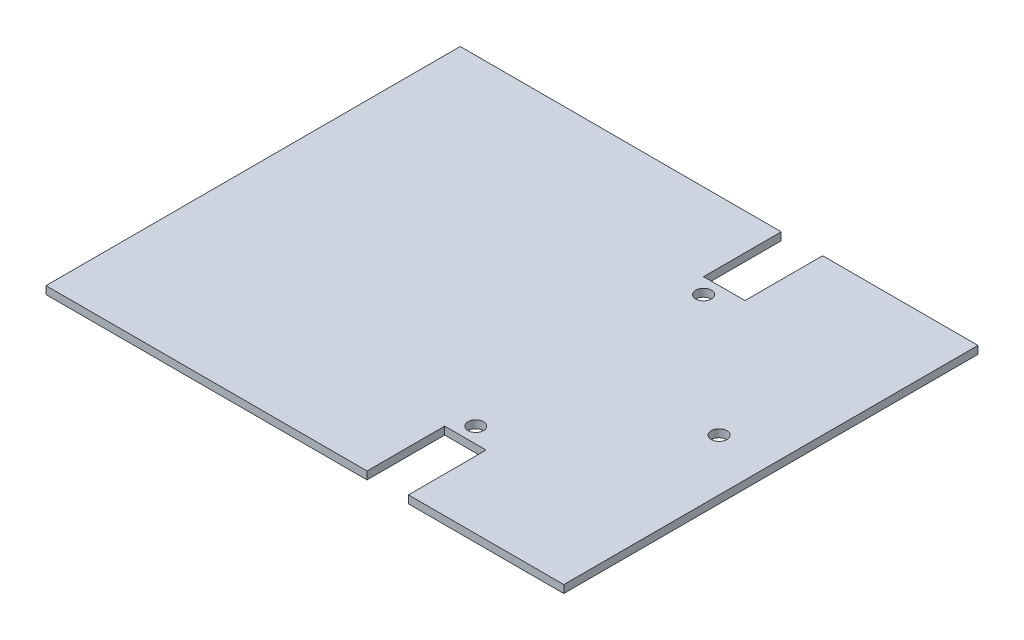
ISO-10303-21;
HEADER;
FILE_DESCRIPTION(('STEP AP214'),'2;1');
FILE_NAME('part.step','',(''),(''),'','','');
FILE_SCHEMA(('AUTOMOTIVE_DESIGN { 1 0 10303 214 1 1 1 1 }'));
ENDSEC;
DATA;
#1=APPLICATION_CONTEXT('core data for automotive mechanical design processes');
#2=APPLICATION_PROTOCOL_DEFINITION('international standard','automotive_design',2000,#1);
#3=PRODUCT_CONTEXT('',#1,'mechanical');
#4=PRODUCT('Part','Part','',(#3));
#5=PRODUCT_RELATED_PRODUCT_CATEGORY('part','',(#4));
#6=PRODUCT_DEFINITION_FORMATION('','',#4);
#7=PRODUCT_DEFINITION_CONTEXT('part definition',#1,'design');
#8=PRODUCT_DEFINITION('design','',#6,#7);
#9=PRODUCT_DEFINITION_SHAPE('','',#8);
#10=(LENGTH_UNIT() NAMED_UNIT(*) SI_UNIT(.MILLI.,.METRE.));
#11=(NAMED_UNIT(*) PLANE_ANGLE_UNIT() SI_UNIT($,.RADIAN.));
#12=(NAMED_UNIT(*) SI_UNIT($,.STERADIAN.) SOLID_ANGLE_UNIT());
#13=UNCERTAINTY_MEASURE_WITH_UNIT(LENGTH_MEASURE(1.E-05),#10,'distance_accuracy_value','');
#14=(GEOMETRIC_REPRESENTATION_CONTEXT(3) GLOBAL_UNCERTAINTY_ASSIGNED_CONTEXT((#13)) GLOBAL_UNIT_ASSIGNED_CONTEXT((#10,
#11,#12)) REPRESENTATION_CONTEXT('',''));
#15=CARTESIAN_POINT('',(0.,0.,0.));
#16=DIRECTION('',(0.,0.,1.));
#17=DIRECTION('',(1.,0.,0.));
#18=AXIS2_PLACEMENT_3D('',#15,#16,#17);
#19=CARTESIAN_POINT('',(0.,1.5,0.));
#20=DIRECTION('',(0.,0.,-1.));
#21=DIRECTION('',(-1.,0.,0.));
#22=AXIS2_PLACEMENT_3D('',#19,#20,#21);
#23=PLANE('',#22);
#24=DIRECTION('',(1.,0.,0.));
#25=VECTOR('',#24,1.);
#26=CARTESIAN_POINT('',(0.,0.,0.));
#27=LINE('',#26,#25);
#28=CARTESIAN_POINT('',(0.,0.,0.));
#29=VERTEX_POINT('',#28);
#30=CARTESIAN_POINT('',(62.,0.,0.));
#31=VERTEX_POINT('',#30);
#32=EDGE_CURVE('E141',#29,#31,#27,.T.);
#33=ORIENTED_EDGE('',*,*,#32,.T.);
#34=DIRECTION('',(0.,1.,0.));
#35=VECTOR('',#34,1.);
#36=CARTESIAN_POINT('',(62.,-0.000999999999999916,0.));
#37=LINE('',#36,#35);
#38=CARTESIAN_POINT('',(62.,1.5,0.));
#39=VERTEX_POINT('',#38);
#40=EDGE_CURVE('E124',#31,#39,#37,.T.);
#41=ORIENTED_EDGE('',*,*,#40,.T.);
#42=DIRECTION('',(1.,0.,0.));
#43=VECTOR('',#42,1.);
#44=CARTESIAN_POINT('',(0.,1.5,0.));
#45=LINE('',#44,#43);
#46=CARTESIAN_POINT('',(0.,1.5,0.));
#47=VERTEX_POINT('',#46);
#48=EDGE_CURVE('E192',#47,#39,#45,.T.);
#49=ORIENTED_EDGE('',*,*,#48,.F.);
#50=DIRECTION('',(0.,-1.,0.));
#51=VECTOR('',#50,1.);
#52=CARTESIAN_POINT('',(0.,1.5,0.));
#53=LINE('',#52,#51);
#54=EDGE_CURVE('E11',#47,#29,#53,.T.);
#55=ORIENTED_EDGE('',*,*,#54,.T.);
#56=EDGE_LOOP('',(#33,#41,#49,#55));
#57=FACE_BOUND('',#56,.T.);
#58=ADVANCED_FACE('F36',(#57),#23,.F.);
#59=CARTESIAN_POINT('',(0.,1.5,-80.));
#60=DIRECTION('',(0.,0.,1.));
#61=DIRECTION('',(1.,0.,0.));
#62=AXIS2_PLACEMENT_3D('',#59,#60,#61);
#63=PLANE('',#62);
#64=DIRECTION('',(-1.,0.,0.));
#65=VECTOR('',#64,1.);
#66=CARTESIAN_POINT('',(0.,1.5,-80.));
#67=LINE('',#66,#65);
#68=CARTESIAN_POINT('',(62.,1.5,-80.));
#69=VERTEX_POINT('',#68);
#70=CARTESIAN_POINT('',(0.,1.5,-80.));
#71=VERTEX_POINT('',#70);
#72=EDGE_CURVE('E189',#69,#71,#67,.T.);
#73=ORIENTED_EDGE('',*,*,#72,.F.);
#74=DIRECTION('',(0.,1.,0.));
#75=VECTOR('',#74,1.);
#76=CARTESIAN_POINT('',(62.,-0.000999999999999916,-80.));
#77=LINE('',#76,#75);
#78=CARTESIAN_POINT('',(62.,0.,-80.));
#79=VERTEX_POINT('',#78);
#80=EDGE_CURVE('E199',#79,#69,#77,.T.);
#81=ORIENTED_EDGE('',*,*,#80,.F.);
#82=DIRECTION('',(-1.,0.,0.));
#83=VECTOR('',#82,1.);
#84=CARTESIAN_POINT('',(0.,0.,-80.));
#85=LINE('',#84,#83);
#86=CARTESIAN_POINT('',(0.,0.,-80.));
#87=VERTEX_POINT('',#86);
#88=EDGE_CURVE('E150',#79,#87,#85,.T.);
#89=ORIENTED_EDGE('',*,*,#88,.T.);
#90=DIRECTION('',(0.,-1.,0.));
#91=VECTOR('',#90,1.);
#92=CARTESIAN_POINT('',(0.,1.5,-80.));
#93=LINE('',#92,#91);
#94=EDGE_CURVE('E160',#71,#87,#93,.T.);
#95=ORIENTED_EDGE('',*,*,#94,.F.);
#96=EDGE_LOOP('',(#73,#81,#89,#95));
#97=FACE_BOUND('',#96,.T.);
#98=ADVANCED_FACE('F265',(#97),#63,.F.);
#99=CARTESIAN_POINT('',(0.,1.5,0.));
#100=DIRECTION('',(1.,0.,0.));
#101=DIRECTION('',(0.,0.,-1.));
#102=AXIS2_PLACEMENT_3D('',#99,#100,#101);
#103=PLANE('',#102);
#104=DIRECTION('',(0.,0.,1.));
#105=VECTOR('',#104,1.);
#106=CARTESIAN_POINT('',(0.,0.,0.));
#107=LINE('',#106,#105);
#108=EDGE_CURVE('E152',#87,#29,#107,.T.);
#109=ORIENTED_EDGE('',*,*,#108,.T.);
#110=ORIENTED_EDGE('',*,*,#54,.F.);
#111=DIRECTION('',(0.,0.,1.));
#112=VECTOR('',#111,1.);
#113=CARTESIAN_POINT('',(0.,1.5,0.));
#114=LINE('',#113,#112);
#115=EDGE_CURVE('E159',#71,#47,#114,.T.);
#116=ORIENTED_EDGE('',*,*,#115,.F.);
#117=ORIENTED_EDGE('',*,*,#94,.T.);
#118=EDGE_LOOP('',(#109,#110,#116,#117));
#119=FACE_BOUND('',#118,.T.);
#120=ADVANCED_FACE('F38',(#119),#103,.F.);
#121=CARTESIAN_POINT('',(70.,1.5,0.));
#122=VERTEX_POINT('',#121);
#123=CARTESIAN_POINT('',(100.,1.5,0.));
#124=VERTEX_POINT('',#123);
#125=EDGE_CURVE('E194',#122,#124,#45,.T.);
#126=ORIENTED_EDGE('',*,*,#125,.F.);
#127=DIRECTION('',(0.,1.,0.));
#128=VECTOR('',#127,1.);
#129=CARTESIAN_POINT('',(70.,-0.000999999999999916,0.));
#130=LINE('',#129,#128);
#131=CARTESIAN_POINT('',(70.,0.,0.));
#132=VERTEX_POINT('',#131);
#133=EDGE_CURVE('E134',#132,#122,#130,.T.);
#134=ORIENTED_EDGE('',*,*,#133,.F.);
#135=CARTESIAN_POINT('',(100.,0.,0.));
#136=VERTEX_POINT('',#135);
#137=EDGE_CURVE('E148',#132,#136,#27,.T.);
#138=ORIENTED_EDGE('',*,*,#137,.T.);
#139=DIRECTION('',(0.,-1.,0.));
#140=VECTOR('',#139,1.);
#141=CARTESIAN_POINT('',(100.,1.5,0.));
#142=LINE('',#141,#140);
#143=EDGE_CURVE('E44',#124,#136,#142,.T.);
#144=ORIENTED_EDGE('',*,*,#143,.F.);
#145=EDGE_LOOP('',(#126,#134,#138,#144));
#146=FACE_BOUND('',#145,.T.);
#147=ADVANCED_FACE('F284',(#146),#23,.F.);
#148=CARTESIAN_POINT('',(100.,1.5,0.));
#149=DIRECTION('',(-1.,0.,0.));
#150=DIRECTION('',(0.,0.,1.));
#151=AXIS2_PLACEMENT_3D('',#148,#149,#150);
#152=PLANE('',#151);
#153=DIRECTION('',(0.,0.,-1.));
#154=VECTOR('',#153,1.);
#155=CARTESIAN_POINT('',(100.,0.,0.));
#156=LINE('',#155,#154);
#157=CARTESIAN_POINT('',(100.,0.,-80.));
#158=VERTEX_POINT('',#157);
#159=EDGE_CURVE('E147',#136,#158,#156,.T.);
#160=ORIENTED_EDGE('',*,*,#159,.T.);
#161=DIRECTION('',(0.,-1.,0.));
#162=VECTOR('',#161,1.);
#163=CARTESIAN_POINT('',(100.,1.5,-80.));
#164=LINE('',#163,#162);
#165=CARTESIAN_POINT('',(100.,1.5,-80.));
#166=VERTEX_POINT('',#165);
#167=EDGE_CURVE('E163',#166,#158,#164,.T.);
#168=ORIENTED_EDGE('',*,*,#167,.F.);
#169=DIRECTION('',(0.,0.,-1.));
#170=VECTOR('',#169,1.);
#171=CARTESIAN_POINT('',(100.,1.5,0.));
#172=LINE('',#171,#170);
#173=EDGE_CURVE('E173',#124,#166,#172,.T.);
#174=ORIENTED_EDGE('',*,*,#173,.F.);
#175=ORIENTED_EDGE('',*,*,#143,.T.);
#176=EDGE_LOOP('',(#160,#168,#174,#175));
#177=FACE_BOUND('',#176,.T.);
#178=ADVANCED_FACE('F171',(#177),#152,.F.);
#179=CARTESIAN_POINT('',(70.,0.,-80.));
#180=VERTEX_POINT('',#179);
#181=EDGE_CURVE('E156',#158,#180,#85,.T.);
#182=ORIENTED_EDGE('',*,*,#181,.T.);
#183=DIRECTION('',(0.,1.,0.));
#184=VECTOR('',#183,1.);
#185=CARTESIAN_POINT('',(70.,-0.000999999999999916,-80.));
#186=LINE('',#185,#184);
#187=CARTESIAN_POINT('',(70.,1.5,-80.));
#188=VERTEX_POINT('',#187);
#189=EDGE_CURVE('E185',#180,#188,#186,.T.);
#190=ORIENTED_EDGE('',*,*,#189,.T.);
#191=EDGE_CURVE('E164',#166,#188,#67,.T.);
#192=ORIENTED_EDGE('',*,*,#191,.F.);
#193=ORIENTED_EDGE('',*,*,#167,.T.);
#194=EDGE_LOOP('',(#182,#190,#192,#193));
#195=FACE_BOUND('',#194,.T.);
#196=ADVANCED_FACE('F183',(#195),#63,.F.);
#197=CARTESIAN_POINT('',(0.,1.5,0.));
#198=DIRECTION('',(0.,-1.,0.));
#199=DIRECTION('',(0.,0.,-1.));
#200=AXIS2_PLACEMENT_3D('',#197,#198,#199);
#201=PLANE('',#200);
#202=CARTESIAN_POINT('',(65.,1.5,-18.));
#203=DIRECTION('',(0.,1.,0.));
#204=DIRECTION('',(0.,0.,1.));
#205=AXIS2_PLACEMENT_3D('',#202,#203,#204);
#206=CIRCLE('',#205,1.5);
#207=CARTESIAN_POINT('',(65.,1.5,-16.5));
#208=VERTEX_POINT('',#207);
#209=EDGE_CURVE('E238',#208,#208,#206,.T.);
#210=ORIENTED_EDGE('',*,*,#209,.F.);
#211=EDGE_LOOP('',(#210));
#212=FACE_BOUND('',#211,.T.);
#213=CARTESIAN_POINT('',(90.,1.5,-40.));
#214=DIRECTION('',(0.,1.,0.));
#215=DIRECTION('',(0.,0.,1.));
#216=AXIS2_PLACEMENT_3D('',#213,#214,#215);
#217=CIRCLE('',#216,1.5);
#218=CARTESIAN_POINT('',(90.,1.5,-38.5));
#219=VERTEX_POINT('',#218);
#220=EDGE_CURVE('E232',#219,#219,#217,.T.);
#221=ORIENTED_EDGE('',*,*,#220,.F.);
#222=EDGE_LOOP('',(#221));
#223=FACE_BOUND('',#222,.T.);
#224=CARTESIAN_POINT('',(65.,1.5,-62.));
#225=DIRECTION('',(0.,1.,0.));
#226=DIRECTION('',(0.,0.,1.));
#227=AXIS2_PLACEMENT_3D('',#224,#225,#226);
#228=CIRCLE('',#227,1.5);
#229=CARTESIAN_POINT('',(65.,1.5,-60.5));
#230=VERTEX_POINT('',#229);
#231=EDGE_CURVE('E228',#230,#230,#228,.T.);
#232=ORIENTED_EDGE('',*,*,#231,.F.);
#233=EDGE_LOOP('',(#232));
#234=FACE_BOUND('',#233,.T.);
#235=ORIENTED_EDGE('',*,*,#48,.T.);
#236=DIRECTION('',(0.,0.,1.));
#237=VECTOR('',#236,1.);
#238=CARTESIAN_POINT('',(62.,1.5,0.));
#239=LINE('',#238,#237);
#240=CARTESIAN_POINT('',(62.,1.5,-15.));
#241=VERTEX_POINT('',#240);
#242=EDGE_CURVE('E130',#241,#39,#239,.T.);
#243=ORIENTED_EDGE('',*,*,#242,.F.);
#244=DIRECTION('',(-1.,0.,0.));
#245=VECTOR('',#244,1.);
#246=CARTESIAN_POINT('',(62.,1.5,-15.));
#247=LINE('',#246,#245);
#248=CARTESIAN_POINT('',(70.,1.5,-15.));
#249=VERTEX_POINT('',#248);
#250=EDGE_CURVE('E135',#249,#241,#247,.T.);
#251=ORIENTED_EDGE('',*,*,#250,.F.);
#252=DIRECTION('',(0.,0.,-1.));
#253=VECTOR('',#252,1.);
#254=CARTESIAN_POINT('',(70.,1.5,0.));
#255=LINE('',#254,#253);
#256=EDGE_CURVE('E222',#122,#249,#255,.T.);
#257=ORIENTED_EDGE('',*,*,#256,.F.);
#258=ORIENTED_EDGE('',*,*,#125,.T.);
#259=ORIENTED_EDGE('',*,*,#173,.T.);
#260=ORIENTED_EDGE('',*,*,#191,.T.);
#261=DIRECTION('',(0.,0.,-1.));
#262=VECTOR('',#261,1.);
#263=CARTESIAN_POINT('',(70.,1.5,-80.));
#264=LINE('',#263,#262);
#265=CARTESIAN_POINT('',(70.,1.5,-65.));
#266=VERTEX_POINT('',#265);
#267=EDGE_CURVE('E202',#266,#188,#264,.T.);
#268=ORIENTED_EDGE('',*,*,#267,.F.);
#269=DIRECTION('',(1.,0.,0.));
#270=VECTOR('',#269,1.);
#271=CARTESIAN_POINT('',(62.,1.5,-65.));
#272=LINE('',#271,#270);
#273=CARTESIAN_POINT('',(62.,1.5,-65.));
#274=VERTEX_POINT('',#273);
#275=EDGE_CURVE('E207',#274,#266,#272,.T.);
#276=ORIENTED_EDGE('',*,*,#275,.F.);
#277=DIRECTION('',(0.,0.,1.));
#278=VECTOR('',#277,1.);
#279=CARTESIAN_POINT('',(62.,1.5,-80.));
#280=LINE('',#279,#278);
#281=EDGE_CURVE('E209',#69,#274,#280,.T.);
#282=ORIENTED_EDGE('',*,*,#281,.F.);
#283=ORIENTED_EDGE('',*,*,#72,.T.);
#284=ORIENTED_EDGE('',*,*,#115,.T.);
#285=EDGE_LOOP('',(#235,#243,#251,#257,#258,#259,#260,#268,#276,#282,#283,#284));
#286=FACE_BOUND('',#285,.T.);
#287=ADVANCED_FACE('F249',(#212,#223,#234,#286),#201,.F.);
#288=CARTESIAN_POINT('',(0.,0.,0.));
#289=DIRECTION('',(0.,-1.,0.));
#290=DIRECTION('',(0.,0.,-1.));
#291=AXIS2_PLACEMENT_3D('',#288,#289,#290);
#292=PLANE('',#291);
#293=CARTESIAN_POINT('',(65.,0.,-18.));
#294=DIRECTION('',(0.,-1.,0.));
#295=DIRECTION('',(0.,0.,-1.));
#296=AXIS2_PLACEMENT_3D('',#293,#294,#295);
#297=CIRCLE('',#296,1.5);
#298=CARTESIAN_POINT('',(65.,0.,-19.5));
#299=VERTEX_POINT('',#298);
#300=EDGE_CURVE('E241',#299,#299,#297,.F.);
#301=ORIENTED_EDGE('',*,*,#300,.T.);
#302=EDGE_LOOP('',(#301));
#303=FACE_BOUND('',#302,.T.);
#304=CARTESIAN_POINT('',(90.,0.,-40.));
#305=DIRECTION('',(0.,-1.,0.));
#306=DIRECTION('',(0.,0.,-1.));
#307=AXIS2_PLACEMENT_3D('',#304,#305,#306);
#308=CIRCLE('',#307,1.5);
#309=CARTESIAN_POINT('',(90.,0.,-41.5));
#310=VERTEX_POINT('',#309);
#311=EDGE_CURVE('E235',#310,#310,#308,.F.);
#312=ORIENTED_EDGE('',*,*,#311,.T.);
#313=EDGE_LOOP('',(#312));
#314=FACE_BOUND('',#313,.T.);
#315=CARTESIAN_POINT('',(65.,0.,-62.));
#316=DIRECTION('',(0.,-1.,0.));
#317=DIRECTION('',(0.,0.,-1.));
#318=AXIS2_PLACEMENT_3D('',#315,#316,#317);
#319=CIRCLE('',#318,1.5);
#320=CARTESIAN_POINT('',(65.,0.,-63.5));
#321=VERTEX_POINT('',#320);
#322=EDGE_CURVE('E229',#321,#321,#319,.F.);
#323=ORIENTED_EDGE('',*,*,#322,.T.);
#324=EDGE_LOOP('',(#323));
#325=FACE_BOUND('',#324,.T.);
#326=DIRECTION('',(0.,0.,1.));
#327=VECTOR('',#326,1.);
#328=CARTESIAN_POINT('',(62.,0.,0.));
#329=LINE('',#328,#327);
#330=CARTESIAN_POINT('',(62.,0.,-15.));
#331=VERTEX_POINT('',#330);
#332=EDGE_CURVE('E127',#331,#31,#329,.T.);
#333=ORIENTED_EDGE('',*,*,#332,.T.);
#334=ORIENTED_EDGE('',*,*,#32,.F.);
#335=ORIENTED_EDGE('',*,*,#108,.F.);
#336=ORIENTED_EDGE('',*,*,#88,.F.);
#337=DIRECTION('',(0.,0.,1.));
#338=VECTOR('',#337,1.);
#339=CARTESIAN_POINT('',(62.,0.,-80.));
#340=LINE('',#339,#338);
#341=CARTESIAN_POINT('',(62.,0.,-65.));
#342=VERTEX_POINT('',#341);
#343=EDGE_CURVE('E212',#79,#342,#340,.T.);
#344=ORIENTED_EDGE('',*,*,#343,.T.);
#345=DIRECTION('',(1.,0.,0.));
#346=VECTOR('',#345,1.);
#347=CARTESIAN_POINT('',(62.,0.,-65.));
#348=LINE('',#347,#346);
#349=CARTESIAN_POINT('',(70.,0.,-65.));
#350=VERTEX_POINT('',#349);
#351=EDGE_CURVE('E197',#342,#350,#348,.T.);
#352=ORIENTED_EDGE('',*,*,#351,.T.);
#353=DIRECTION('',(0.,0.,-1.));
#354=VECTOR('',#353,1.);
#355=CARTESIAN_POINT('',(70.,0.,-80.));
#356=LINE('',#355,#354);
#357=EDGE_CURVE('E180',#350,#180,#356,.T.);
#358=ORIENTED_EDGE('',*,*,#357,.T.);
#359=ORIENTED_EDGE('',*,*,#181,.F.);
#360=ORIENTED_EDGE('',*,*,#159,.F.);
#361=ORIENTED_EDGE('',*,*,#137,.F.);
#362=DIRECTION('',(0.,0.,-1.));
#363=VECTOR('',#362,1.);
#364=CARTESIAN_POINT('',(70.,0.,0.));
#365=LINE('',#364,#363);
#366=CARTESIAN_POINT('',(70.,0.,-15.));
#367=VERTEX_POINT('',#366);
#368=EDGE_CURVE('E226',#132,#367,#365,.T.);
#369=ORIENTED_EDGE('',*,*,#368,.T.);
#370=DIRECTION('',(-1.,0.,0.));
#371=VECTOR('',#370,1.);
#372=CARTESIAN_POINT('',(62.,0.,-15.));
#373=LINE('',#372,#371);
#374=EDGE_CURVE('E143',#367,#331,#373,.T.);
#375=ORIENTED_EDGE('',*,*,#374,.T.);
#376=EDGE_LOOP('',(#333,#334,#335,#336,#344,#352,#358,#359,#360,#361,#369,#375));
#377=FACE_BOUND('',#376,.T.);
#378=ADVANCED_FACE('F139',(#303,#314,#325,#377),#292,.T.);
#379=CARTESIAN_POINT('',(62.,-0.000999999999999916,-80.));
#380=DIRECTION('',(-1.,0.,0.));
#381=DIRECTION('',(0.,0.,1.));
#382=AXIS2_PLACEMENT_3D('',#379,#380,#381);
#383=PLANE('',#382);
#384=ORIENTED_EDGE('',*,*,#80,.T.);
#385=ORIENTED_EDGE('',*,*,#281,.T.);
#386=DIRECTION('',(0.,1.,0.));
#387=VECTOR('',#386,1.);
#388=CARTESIAN_POINT('',(62.,-0.000999999999999916,-65.));
#389=LINE('',#388,#387);
#390=EDGE_CURVE('E200',#342,#274,#389,.T.);
#391=ORIENTED_EDGE('',*,*,#390,.F.);
#392=ORIENTED_EDGE('',*,*,#343,.F.);
#393=EDGE_LOOP('',(#384,#385,#391,#392));
#394=FACE_BOUND('',#393,.T.);
#395=ADVANCED_FACE('F267',(#394),#383,.F.);
#396=CARTESIAN_POINT('',(70.,-0.000999999999999916,-80.));
#397=DIRECTION('',(1.,0.,0.));
#398=DIRECTION('',(0.,0.,-1.));
#399=AXIS2_PLACEMENT_3D('',#396,#397,#398);
#400=PLANE('',#399);
#401=DIRECTION('',(0.,1.,0.));
#402=VECTOR('',#401,1.);
#403=CARTESIAN_POINT('',(70.,-0.000999999999999916,-65.));
#404=LINE('',#403,#402);
#405=EDGE_CURVE('E59',#350,#266,#404,.T.);
#406=ORIENTED_EDGE('',*,*,#405,.T.);
#407=ORIENTED_EDGE('',*,*,#267,.T.);
#408=ORIENTED_EDGE('',*,*,#189,.F.);
#409=ORIENTED_EDGE('',*,*,#357,.F.);
#410=EDGE_LOOP('',(#406,#407,#408,#409));
#411=FACE_BOUND('',#410,.T.);
#412=ADVANCED_FACE('F272',(#411),#400,.F.);
#413=CARTESIAN_POINT('',(62.,-0.000999999999999916,-65.));
#414=DIRECTION('',(0.,0.,1.));
#415=DIRECTION('',(1.,0.,0.));
#416=AXIS2_PLACEMENT_3D('',#413,#414,#415);
#417=PLANE('',#416);
#418=ORIENTED_EDGE('',*,*,#390,.T.);
#419=ORIENTED_EDGE('',*,*,#275,.T.);
#420=ORIENTED_EDGE('',*,*,#405,.F.);
#421=ORIENTED_EDGE('',*,*,#351,.F.);
#422=EDGE_LOOP('',(#418,#419,#420,#421));
#423=FACE_BOUND('',#422,.T.);
#424=ADVANCED_FACE('F270',(#423),#417,.F.);
#425=CARTESIAN_POINT('',(62.,-0.000999999999999916,0.));
#426=DIRECTION('',(-1.,0.,0.));
#427=DIRECTION('',(0.,0.,1.));
#428=AXIS2_PLACEMENT_3D('',#425,#426,#427);
#429=PLANE('',#428);
#430=DIRECTION('',(0.,1.,0.));
#431=VECTOR('',#430,1.);
#432=CARTESIAN_POINT('',(62.,-0.000999999999999916,-15.));
#433=LINE('',#432,#431);
#434=EDGE_CURVE('E215',#331,#241,#433,.T.);
#435=ORIENTED_EDGE('',*,*,#434,.T.);
#436=ORIENTED_EDGE('',*,*,#242,.T.);
#437=ORIENTED_EDGE('',*,*,#40,.F.);
#438=ORIENTED_EDGE('',*,*,#332,.F.);
#439=EDGE_LOOP('',(#435,#436,#437,#438));
#440=FACE_BOUND('',#439,.T.);
#441=ADVANCED_FACE('F126',(#440),#429,.F.);
#442=CARTESIAN_POINT('',(62.,-0.000999999999999916,-15.));
#443=DIRECTION('',(0.,0.,-1.));
#444=DIRECTION('',(-1.,0.,0.));
#445=AXIS2_PLACEMENT_3D('',#442,#443,#444);
#446=PLANE('',#445);
#447=DIRECTION('',(0.,1.,0.));
#448=VECTOR('',#447,1.);
#449=CARTESIAN_POINT('',(70.,-0.000999999999999916,-15.));
#450=LINE('',#449,#448);
#451=EDGE_CURVE('E51',#367,#249,#450,.T.);
#452=ORIENTED_EDGE('',*,*,#451,.T.);
#453=ORIENTED_EDGE('',*,*,#250,.T.);
#454=ORIENTED_EDGE('',*,*,#434,.F.);
#455=ORIENTED_EDGE('',*,*,#374,.F.);
#456=EDGE_LOOP('',(#452,#453,#454,#455));
#457=FACE_BOUND('',#456,.T.);
#458=ADVANCED_FACE('F278',(#457),#446,.F.);
#459=CARTESIAN_POINT('',(70.,-0.000999999999999916,0.));
#460=DIRECTION('',(1.,0.,0.));
#461=DIRECTION('',(0.,0.,-1.));
#462=AXIS2_PLACEMENT_3D('',#459,#460,#461);
#463=PLANE('',#462);
#464=ORIENTED_EDGE('',*,*,#133,.T.);
#465=ORIENTED_EDGE('',*,*,#256,.T.);
#466=ORIENTED_EDGE('',*,*,#451,.F.);
#467=ORIENTED_EDGE('',*,*,#368,.F.);
#468=EDGE_LOOP('',(#464,#465,#466,#467));
#469=FACE_BOUND('',#468,.T.);
#470=ADVANCED_FACE('F297',(#469),#463,.F.);
#471=CARTESIAN_POINT('',(65.,-0.000999999999999916,-62.));
#472=DIRECTION('',(0.,1.,0.));
#473=DIRECTION('',(0.,0.,1.));
#474=AXIS2_PLACEMENT_3D('',#471,#472,#473);
#475=CYLINDRICAL_SURFACE('',#474,1.5);
#476=ORIENTED_EDGE('',*,*,#322,.F.);
#477=EDGE_LOOP('',(#476));
#478=FACE_BOUND('',#477,.T.);
#479=ORIENTED_EDGE('',*,*,#231,.T.);
#480=EDGE_LOOP('',(#479));
#481=FACE_BOUND('',#480,.T.);
#482=ADVANCED_FACE('F299',(#478,#481),#475,.F.);
#483=CARTESIAN_POINT('',(90.,-0.000999999999999916,-40.));
#484=DIRECTION('',(0.,1.,0.));
#485=DIRECTION('',(0.,0.,1.));
#486=AXIS2_PLACEMENT_3D('',#483,#484,#485);
#487=CYLINDRICAL_SURFACE('',#486,1.5);
#488=ORIENTED_EDGE('',*,*,#311,.F.);
#489=EDGE_LOOP('',(#488));
#490=FACE_BOUND('',#489,.T.);
#491=ORIENTED_EDGE('',*,*,#220,.T.);
#492=EDGE_LOOP('',(#491));
#493=FACE_BOUND('',#492,.T.);
#494=ADVANCED_FACE('F305',(#490,#493),#487,.F.);
#495=CARTESIAN_POINT('',(65.,-0.000999999999999916,-18.));
#496=DIRECTION('',(0.,1.,0.));
#497=DIRECTION('',(0.,0.,1.));
#498=AXIS2_PLACEMENT_3D('',#495,#496,#497);
#499=CYLINDRICAL_SURFACE('',#498,1.5);
#500=ORIENTED_EDGE('',*,*,#300,.F.);
#501=EDGE_LOOP('',(#500));
#502=FACE_BOUND('',#501,.T.);
#503=ORIENTED_EDGE('',*,*,#209,.T.);
#504=EDGE_LOOP('',(#503));
#505=FACE_BOUND('',#504,.T.);
#506=ADVANCED_FACE('F247',(#502,#505),#499,.F.);
#507=CLOSED_SHELL('',(#58,#98,#120,#147,#178,#196,#287,#378,#395,#412,#424,#441,#458,#470,#482,
#494,#506));
#508=MANIFOLD_SOLID_BREP('B2',#507);
#509=ADVANCED_BREP_SHAPE_REPRESENTATION('',(#18,#508),#14);
#510=SHAPE_DEFINITION_REPRESENTATION(#9,#509);
ENDSEC;
END-ISO-10303-21;
